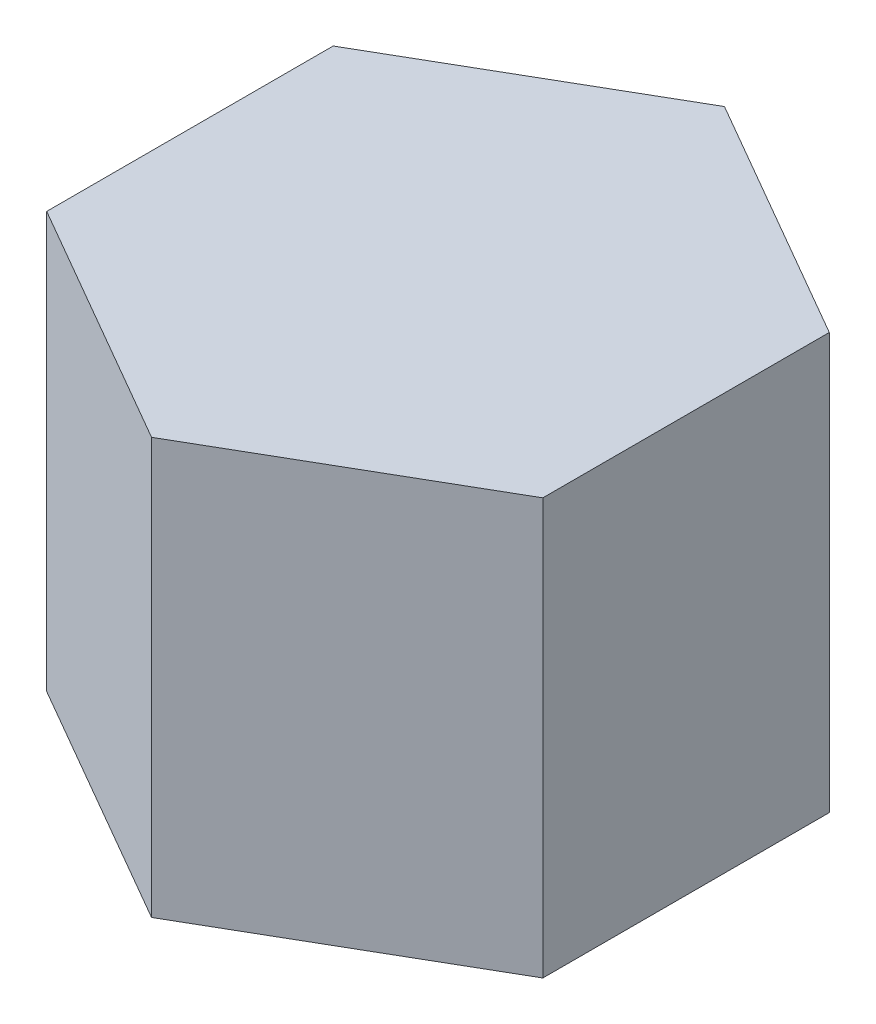
ISO-10303-21;
HEADER;
FILE_DESCRIPTION(('STEP AP214'),'2;1');
FILE_NAME('part.step','',(''),(''),'','','');
FILE_SCHEMA(('AUTOMOTIVE_DESIGN { 1 0 10303 214 1 1 1 1 }'));
ENDSEC;
DATA;
#1=APPLICATION_CONTEXT('core data for automotive mechanical design processes');
#2=APPLICATION_PROTOCOL_DEFINITION('international standard','automotive_design',2000,#1);
#3=PRODUCT_CONTEXT('',#1,'mechanical');
#4=PRODUCT('Part','Part','',(#3));
#5=PRODUCT_RELATED_PRODUCT_CATEGORY('part','',(#4));
#6=PRODUCT_DEFINITION_FORMATION('','',#4);
#7=PRODUCT_DEFINITION_CONTEXT('part definition',#1,'design');
#8=PRODUCT_DEFINITION('design','',#6,#7);
#9=PRODUCT_DEFINITION_SHAPE('','',#8);
#10=(LENGTH_UNIT() NAMED_UNIT(*) SI_UNIT(.MILLI.,.METRE.));
#11=(NAMED_UNIT(*) PLANE_ANGLE_UNIT() SI_UNIT($,.RADIAN.));
#12=(NAMED_UNIT(*) SI_UNIT($,.STERADIAN.) SOLID_ANGLE_UNIT());
#13=UNCERTAINTY_MEASURE_WITH_UNIT(LENGTH_MEASURE(1.E-05),#10,'distance_accuracy_value','');
#14=(GEOMETRIC_REPRESENTATION_CONTEXT(3) GLOBAL_UNCERTAINTY_ASSIGNED_CONTEXT((#13)) GLOBAL_UNIT_ASSIGNED_CONTEXT((#10,
#11,#12)) REPRESENTATION_CONTEXT('',''));
#15=CARTESIAN_POINT('',(0.,0.,0.));
#16=DIRECTION('',(0.,0.,1.));
#17=DIRECTION('',(1.,0.,0.));
#18=AXIS2_PLACEMENT_3D('',#15,#16,#17);
#19=CARTESIAN_POINT('',(205.142660308706,-148.537700895744,294.105047431848));
#20=DIRECTION('',(-0.499999999999943,0.,-0.866025403784472));
#21=DIRECTION('',(-0.866025403784472,0.,0.499999999999943));
#22=AXIS2_PLACEMENT_3D('',#19,#20,#21);
#23=PLANE('',#22);
#24=CARTESIAN_POINT('',(204.839551417381,-149.045793579175,294.280047431848));
#25=DIRECTION('',(0.866025403784471,0.,-0.499999999999943));
#26=VECTOR('',#25,1.);
#27=LINE('',#24,#26);
#28=CARTESIAN_POINT('',(204.839551417382,-149.045793579175,294.280047431848));
#29=VERTEX_POINT('',#28);
#30=CARTESIAN_POINT('',(205.142660308706,-149.045793579175,294.105047431848));
#31=VERTEX_POINT('',#30);
#32=EDGE_CURVE('E170',#29,#31,#27,.T.);
#33=ORIENTED_EDGE('',*,*,#32,.T.);
#34=CARTESIAN_POINT('',(205.142660308706,-148.537700895744,294.105047431848));
#35=DIRECTION('',(0.,-1.,0.));
#36=VECTOR('',#35,1.);
#37=LINE('',#34,#36);
#38=CARTESIAN_POINT('',(205.142660308706,-148.537700895744,294.105047431848));
#39=VERTEX_POINT('',#38);
#40=EDGE_CURVE('E35',#39,#31,#37,.T.);
#41=ORIENTED_EDGE('',*,*,#40,.F.);
#42=CARTESIAN_POINT('',(204.839551417381,-148.537700895744,294.280047431848));
#43=DIRECTION('',(0.866025403784471,0.,-0.499999999999943));
#44=VECTOR('',#43,1.);
#45=LINE('',#42,#44);
#46=CARTESIAN_POINT('',(204.839551417382,-148.537700895744,294.280047431848));
#47=VERTEX_POINT('',#46);
#48=EDGE_CURVE('E159',#47,#39,#45,.T.);
#49=ORIENTED_EDGE('',*,*,#48,.F.);
#50=CARTESIAN_POINT('',(204.839551417381,-148.537700895744,294.280047431848));
#51=DIRECTION('',(0.,-1.,0.));
#52=VECTOR('',#51,1.);
#53=LINE('',#50,#52);
#54=EDGE_CURVE('E10',#47,#29,#53,.T.);
#55=ORIENTED_EDGE('',*,*,#54,.T.);
#56=EDGE_LOOP('',(#33,#41,#49,#55));
#57=FACE_BOUND('',#56,.T.);
#58=ADVANCED_FACE('F16',(#57),#23,.F.);
#59=CARTESIAN_POINT('',(204.839551417382,-148.537700895744,294.280047431848));
#60=DIRECTION('',(0.500000000000062,0.,-0.866025403784403));
#61=DIRECTION('',(-0.866025403784403,0.,-0.500000000000062));
#62=AXIS2_PLACEMENT_3D('',#59,#60,#61);
#63=PLANE('',#62);
#64=CARTESIAN_POINT('',(204.536442526057,-149.045793579175,294.105047431848));
#65=DIRECTION('',(0.866025403784403,0.,0.500000000000062));
#66=VECTOR('',#65,1.);
#67=LINE('',#64,#66);
#68=CARTESIAN_POINT('',(204.536442526057,-149.045793579175,294.105047431848));
#69=VERTEX_POINT('',#68);
#70=EDGE_CURVE('E167',#69,#29,#67,.T.);
#71=ORIENTED_EDGE('',*,*,#70,.T.);
#72=ORIENTED_EDGE('',*,*,#54,.F.);
#73=CARTESIAN_POINT('',(204.536442526057,-148.537700895744,294.105047431848));
#74=DIRECTION('',(0.866025403784403,0.,0.500000000000062));
#75=VECTOR('',#74,1.);
#76=LINE('',#73,#75);
#77=CARTESIAN_POINT('',(204.536442526057,-148.537700895744,294.105047431848));
#78=VERTEX_POINT('',#77);
#79=EDGE_CURVE('E156',#78,#47,#76,.T.);
#80=ORIENTED_EDGE('',*,*,#79,.F.);
#81=CARTESIAN_POINT('',(204.536442526057,-148.537700895744,294.105047431848));
#82=DIRECTION('',(0.,-1.,0.));
#83=VECTOR('',#82,1.);
#84=LINE('',#81,#83);
#85=EDGE_CURVE('E27',#78,#69,#84,.T.);
#86=ORIENTED_EDGE('',*,*,#85,.T.);
#87=EDGE_LOOP('',(#71,#72,#80,#86));
#88=FACE_BOUND('',#87,.T.);
#89=ADVANCED_FACE('F189',(#88),#63,.F.);
#90=CARTESIAN_POINT('',(204.536442526057,-148.537700895744,290.831971220494));
#91=DIRECTION('',(1.,0.,0.));
#92=DIRECTION('',(0.,1.,0.));
#93=AXIS2_PLACEMENT_3D('',#90,#91,#92);
#94=PLANE('',#93);
#95=CARTESIAN_POINT('',(204.536442526057,-149.045793579175,293.755047431848));
#96=DIRECTION('',(0.,0.,1.));
#97=VECTOR('',#96,1.);
#98=LINE('',#95,#97);
#99=CARTESIAN_POINT('',(204.536442526057,-149.045793579175,293.755047431848));
#100=VERTEX_POINT('',#99);
#101=EDGE_CURVE('E163',#100,#69,#98,.T.);
#102=ORIENTED_EDGE('',*,*,#101,.T.);
#103=ORIENTED_EDGE('',*,*,#85,.F.);
#104=CARTESIAN_POINT('',(204.536442526057,-148.537700895744,293.755047431848));
#105=DIRECTION('',(0.,0.,1.));
#106=VECTOR('',#105,1.);
#107=LINE('',#104,#106);
#108=CARTESIAN_POINT('',(204.536442526057,-148.537700895744,293.755047431848));
#109=VERTEX_POINT('',#108);
#110=EDGE_CURVE('E106',#109,#78,#107,.T.);
#111=ORIENTED_EDGE('',*,*,#110,.F.);
#112=CARTESIAN_POINT('',(204.536442526057,-148.537700895744,293.755047431848));
#113=DIRECTION('',(0.,-1.,0.));
#114=VECTOR('',#113,1.);
#115=LINE('',#112,#114);
#116=EDGE_CURVE('E94',#109,#100,#115,.T.);
#117=ORIENTED_EDGE('',*,*,#116,.T.);
#118=EDGE_LOOP('',(#102,#103,#111,#117));
#119=FACE_BOUND('',#118,.T.);
#120=ADVANCED_FACE('F198',(#119),#94,.F.);
#121=CARTESIAN_POINT('',(204.536442526057,-148.537700895744,293.755047431848));
#122=DIRECTION('',(0.499999999999978,0.,0.866025403784452));
#123=DIRECTION('',(0.866025403784452,0.,-0.499999999999978));
#124=AXIS2_PLACEMENT_3D('',#121,#122,#123);
#125=PLANE('',#124);
#126=CARTESIAN_POINT('',(204.839551417382,-149.045793579175,293.580047431848));
#127=DIRECTION('',(-0.866025403784452,0.,0.499999999999978));
#128=VECTOR('',#127,1.);
#129=LINE('',#126,#128);
#130=CARTESIAN_POINT('',(204.839551417382,-149.045793579175,293.580047431848));
#131=VERTEX_POINT('',#130);
#132=EDGE_CURVE('E162',#131,#100,#129,.T.);
#133=ORIENTED_EDGE('',*,*,#132,.T.);
#134=ORIENTED_EDGE('',*,*,#116,.F.);
#135=CARTESIAN_POINT('',(204.839551417382,-148.537700895744,293.580047431848));
#136=DIRECTION('',(-0.866025403784452,0.,0.499999999999978));
#137=VECTOR('',#136,1.);
#138=LINE('',#135,#137);
#139=CARTESIAN_POINT('',(204.839551417382,-148.537700895744,293.580047431848));
#140=VERTEX_POINT('',#139);
#141=EDGE_CURVE('E98',#140,#109,#138,.T.);
#142=ORIENTED_EDGE('',*,*,#141,.F.);
#143=CARTESIAN_POINT('',(204.839551417382,-148.537700895744,293.580047431848));
#144=DIRECTION('',(0.,-1.,0.));
#145=VECTOR('',#144,1.);
#146=LINE('',#143,#145);
#147=EDGE_CURVE('E79',#140,#131,#146,.T.);
#148=ORIENTED_EDGE('',*,*,#147,.T.);
#149=EDGE_LOOP('',(#133,#134,#142,#148));
#150=FACE_BOUND('',#149,.T.);
#151=ADVANCED_FACE('F100',(#150),#125,.F.);
#152=CARTESIAN_POINT('',(204.839551417382,-148.537700895744,293.580047431848));
#153=DIRECTION('',(-0.500000000000012,0.,0.866025403784432));
#154=DIRECTION('',(0.866025403784432,0.,0.500000000000012));
#155=AXIS2_PLACEMENT_3D('',#152,#153,#154);
#156=PLANE('',#155);
#157=CARTESIAN_POINT('',(205.142660308706,-149.045793579175,293.755047431848));
#158=DIRECTION('',(-0.866025403784432,0.,-0.500000000000012));
#159=VECTOR('',#158,1.);
#160=LINE('',#157,#159);
#161=CARTESIAN_POINT('',(205.142660308706,-149.045793579175,293.755047431848));
#162=VERTEX_POINT('',#161);
#163=EDGE_CURVE('E88',#162,#131,#160,.T.);
#164=ORIENTED_EDGE('',*,*,#163,.T.);
#165=ORIENTED_EDGE('',*,*,#147,.F.);
#166=CARTESIAN_POINT('',(205.142660308706,-148.537700895744,293.755047431848));
#167=DIRECTION('',(-0.866025403784432,0.,-0.500000000000012));
#168=VECTOR('',#167,1.);
#169=LINE('',#166,#168);
#170=CARTESIAN_POINT('',(205.142660308706,-148.537700895744,293.755047431848));
#171=VERTEX_POINT('',#170);
#172=EDGE_CURVE('E84',#171,#140,#169,.T.);
#173=ORIENTED_EDGE('',*,*,#172,.F.);
#174=CARTESIAN_POINT('',(205.142660308706,-148.537700895744,293.755047431848));
#175=DIRECTION('',(0.,-1.,0.));
#176=VECTOR('',#175,1.);
#177=LINE('',#174,#176);
#178=EDGE_CURVE('E58',#171,#162,#177,.T.);
#179=ORIENTED_EDGE('',*,*,#178,.T.);
#180=EDGE_LOOP('',(#164,#165,#173,#179));
#181=FACE_BOUND('',#180,.T.);
#182=ADVANCED_FACE('F82',(#181),#156,.F.);
#183=CARTESIAN_POINT('',(205.142660308706,-148.537700895744,290.831971220494));
#184=DIRECTION('',(-1.,0.,0.));
#185=DIRECTION('',(0.,-1.,0.));
#186=AXIS2_PLACEMENT_3D('',#183,#184,#185);
#187=PLANE('',#186);
#188=CARTESIAN_POINT('',(205.142660308706,-149.045793579175,294.105047431848));
#189=DIRECTION('',(0.,0.,-1.));
#190=VECTOR('',#189,1.);
#191=LINE('',#188,#190);
#192=EDGE_CURVE('E160',#31,#162,#191,.T.);
#193=ORIENTED_EDGE('',*,*,#192,.T.);
#194=ORIENTED_EDGE('',*,*,#178,.F.);
#195=CARTESIAN_POINT('',(205.142660308706,-148.537700895744,294.105047431848));
#196=DIRECTION('',(0.,0.,-1.));
#197=VECTOR('',#196,1.);
#198=LINE('',#195,#197);
#199=EDGE_CURVE('E112',#39,#171,#198,.T.);
#200=ORIENTED_EDGE('',*,*,#199,.F.);
#201=ORIENTED_EDGE('',*,*,#40,.T.);
#202=EDGE_LOOP('',(#193,#194,#200,#201));
#203=FACE_BOUND('',#202,.T.);
#204=ADVANCED_FACE('F131',(#203),#187,.F.);
#205=CARTESIAN_POINT('',(206.339551417382,-148.537700895744,290.831971220494));
#206=DIRECTION('',(0.,-1.,0.));
#207=DIRECTION('',(1.,0.,0.));
#208=AXIS2_PLACEMENT_3D('',#205,#206,#207);
#209=PLANE('',#208);
#210=ORIENTED_EDGE('',*,*,#48,.T.);
#211=ORIENTED_EDGE('',*,*,#199,.T.);
#212=ORIENTED_EDGE('',*,*,#172,.T.);
#213=ORIENTED_EDGE('',*,*,#141,.T.);
#214=ORIENTED_EDGE('',*,*,#110,.T.);
#215=ORIENTED_EDGE('',*,*,#79,.T.);
#216=EDGE_LOOP('',(#210,#211,#212,#213,#214,#215));
#217=FACE_BOUND('',#216,.T.);
#218=ADVANCED_FACE('F111',(#217),#209,.F.);
#219=CARTESIAN_POINT('',(206.339551417382,-149.045793579175,290.831971220494));
#220=DIRECTION('',(0.,-1.,0.));
#221=DIRECTION('',(1.,0.,0.));
#222=AXIS2_PLACEMENT_3D('',#219,#220,#221);
#223=PLANE('',#222);
#224=ORIENTED_EDGE('',*,*,#32,.F.);
#225=ORIENTED_EDGE('',*,*,#70,.F.);
#226=ORIENTED_EDGE('',*,*,#101,.F.);
#227=ORIENTED_EDGE('',*,*,#132,.F.);
#228=ORIENTED_EDGE('',*,*,#163,.F.);
#229=ORIENTED_EDGE('',*,*,#192,.F.);
#230=EDGE_LOOP('',(#224,#225,#226,#227,#228,#229));
#231=FACE_BOUND('',#230,.T.);
#232=ADVANCED_FACE('F130',(#231),#223,.T.);
#233=CLOSED_SHELL('',(#58,#89,#120,#151,#182,#204,#218,#232));
#234=MANIFOLD_SOLID_BREP('B1',#233);
#235=ADVANCED_BREP_SHAPE_REPRESENTATION('',(#18,#234),#14);
#236=SHAPE_DEFINITION_REPRESENTATION(#9,#235);
ENDSEC;
END-ISO-10303-21;
